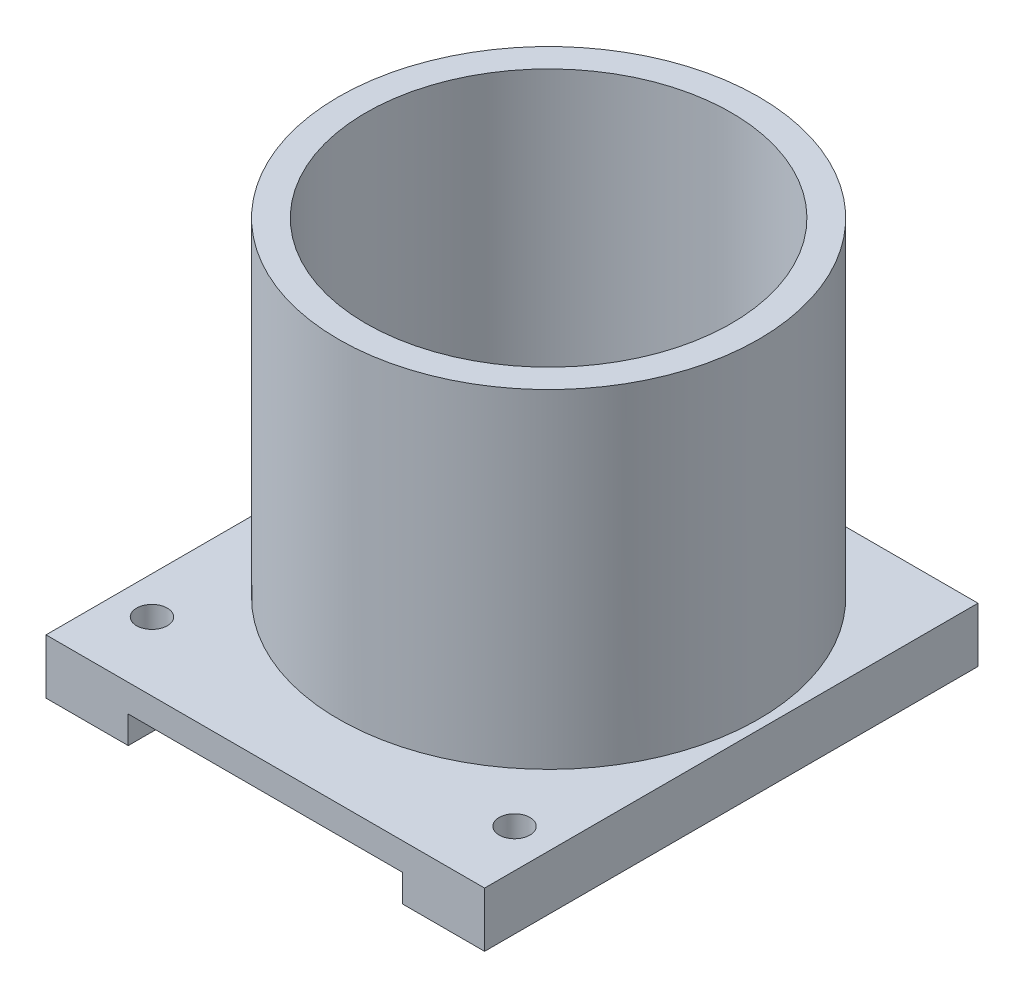
ISO-10303-21;
HEADER;
FILE_DESCRIPTION(('STEP AP214'),'2;1');
FILE_NAME('part.step','',(''),(''),'','','');
FILE_SCHEMA(('AUTOMOTIVE_DESIGN { 1 0 10303 214 1 1 1 1 }'));
ENDSEC;
DATA;
#1=APPLICATION_CONTEXT('core data for automotive mechanical design processes');
#2=APPLICATION_PROTOCOL_DEFINITION('international standard','automotive_design',2000,#1);
#3=PRODUCT_CONTEXT('',#1,'mechanical');
#4=PRODUCT('Part','Part','',(#3));
#5=PRODUCT_RELATED_PRODUCT_CATEGORY('part','',(#4));
#6=PRODUCT_DEFINITION_FORMATION('','',#4);
#7=PRODUCT_DEFINITION_CONTEXT('part definition',#1,'design');
#8=PRODUCT_DEFINITION('design','',#6,#7);
#9=PRODUCT_DEFINITION_SHAPE('','',#8);
#10=(LENGTH_UNIT() NAMED_UNIT(*) SI_UNIT(.MILLI.,.METRE.));
#11=(NAMED_UNIT(*) PLANE_ANGLE_UNIT() SI_UNIT($,.RADIAN.));
#12=(NAMED_UNIT(*) SI_UNIT($,.STERADIAN.) SOLID_ANGLE_UNIT());
#13=UNCERTAINTY_MEASURE_WITH_UNIT(LENGTH_MEASURE(1.E-05),#10,'distance_accuracy_value','');
#14=(GEOMETRIC_REPRESENTATION_CONTEXT(3) GLOBAL_UNCERTAINTY_ASSIGNED_CONTEXT((#13)) GLOBAL_UNIT_ASSIGNED_CONTEXT((#10,
#11,#12)) REPRESENTATION_CONTEXT('',''));
#15=CARTESIAN_POINT('',(0.,0.,0.));
#16=DIRECTION('',(0.,0.,1.));
#17=DIRECTION('',(1.,0.,0.));
#18=AXIS2_PLACEMENT_3D('',#15,#16,#17);
#19=CARTESIAN_POINT('',(0.,-3.175,0.));
#20=DIRECTION('',(0.,-1.,0.));
#21=DIRECTION('',(0.,0.,-1.));
#22=AXIS2_PLACEMENT_3D('',#19,#20,#21);
#23=PLANE('',#22);
#24=DIRECTION('',(0.,0.,1.));
#25=VECTOR('',#24,1.);
#26=CARTESIAN_POINT('',(7.9375,-3.175,18.5411314784116));
#27=LINE('',#26,#25);
#28=CARTESIAN_POINT('',(7.9375,-3.175,-12.1666));
#29=VERTEX_POINT('',#28);
#30=CARTESIAN_POINT('',(7.9375,-3.175,16.4084));
#31=VERTEX_POINT('',#30);
#32=EDGE_CURVE('E117',#29,#31,#27,.T.);
#33=ORIENTED_EDGE('',*,*,#32,.F.);
#34=DIRECTION('',(1.,0.,0.));
#35=VECTOR('',#34,1.);
#36=CARTESIAN_POINT('',(-12.7,-3.175,-12.1666));
#37=LINE('',#36,#35);
#38=CARTESIAN_POINT('',(12.7,-3.175,-12.1666));
#39=VERTEX_POINT('',#38);
#40=EDGE_CURVE('E129',#29,#39,#37,.T.);
#41=ORIENTED_EDGE('',*,*,#40,.T.);
#42=DIRECTION('',(0.,0.,1.));
#43=VECTOR('',#42,1.);
#44=CARTESIAN_POINT('',(12.7,-3.175,16.4084));
#45=LINE('',#44,#43);
#46=CARTESIAN_POINT('',(12.7,-3.175,16.4084));
#47=VERTEX_POINT('',#46);
#48=EDGE_CURVE('E155',#39,#47,#45,.T.);
#49=ORIENTED_EDGE('',*,*,#48,.T.);
#50=DIRECTION('',(-1.,0.,0.));
#51=VECTOR('',#50,1.);
#52=CARTESIAN_POINT('',(-12.7,-3.175,16.4084));
#53=LINE('',#52,#51);
#54=EDGE_CURVE('E131',#47,#31,#53,.T.);
#55=ORIENTED_EDGE('',*,*,#54,.T.);
#56=EDGE_LOOP('',(#33,#41,#49,#55));
#57=FACE_BOUND('',#56,.T.);
#58=CARTESIAN_POINT('',(10.4684762650792,-3.175,-0.058620672138098));
#59=DIRECTION('',(0.,-1.,0.));
#60=DIRECTION('',(0.,0.,-1.));
#61=AXIS2_PLACEMENT_3D('',#58,#59,#60);
#62=CIRCLE('',#61,0.888999999999989);
#63=CARTESIAN_POINT('',(10.4684762650792,-3.175,-0.947620672138087));
#64=VERTEX_POINT('',#63);
#65=EDGE_CURVE('E195',#64,#64,#62,.T.);
#66=ORIENTED_EDGE('',*,*,#65,.F.);
#67=EDGE_LOOP('',(#66));
#68=FACE_BOUND('',#67,.T.);
#69=CARTESIAN_POINT('',(10.4684762650792,-3.175,12.4413793278619));
#70=DIRECTION('',(0.,-1.,0.));
#71=DIRECTION('',(0.,0.,-1.));
#72=AXIS2_PLACEMENT_3D('',#69,#70,#71);
#73=CIRCLE('',#72,0.888999999999989);
#74=CARTESIAN_POINT('',(10.4684762650792,-3.175,11.5523793278619));
#75=VERTEX_POINT('',#74);
#76=EDGE_CURVE('E201',#75,#75,#73,.T.);
#77=ORIENTED_EDGE('',*,*,#76,.F.);
#78=EDGE_LOOP('',(#77));
#79=FACE_BOUND('',#78,.T.);
#80=ADVANCED_FACE('F37',(#57,#68,#79),#23,.T.);
#81=CARTESIAN_POINT('',(0.,19.05,0.));
#82=DIRECTION('',(0.,-1.,0.));
#83=DIRECTION('',(0.,0.,-1.));
#84=AXIS2_PLACEMENT_3D('',#81,#82,#83);
#85=CYLINDRICAL_SURFACE('',#84,6.35);
#86=CARTESIAN_POINT('',(0.,0.127000000000002,0.));
#87=DIRECTION('',(0.,-1.,0.));
#88=DIRECTION('',(0.,0.,-1.));
#89=AXIS2_PLACEMENT_3D('',#86,#87,#88);
#90=CIRCLE('',#89,6.35);
#91=CARTESIAN_POINT('',(0.,0.127000000000002,-6.35));
#92=VERTEX_POINT('',#91);
#93=EDGE_CURVE('E149',#92,#92,#90,.T.);
#94=ORIENTED_EDGE('',*,*,#93,.F.);
#95=EDGE_LOOP('',(#94));
#96=FACE_BOUND('',#95,.T.);
#97=CARTESIAN_POINT('',(0.,-1.5875,0.));
#98=DIRECTION('',(0.,-1.,0.));
#99=DIRECTION('',(0.,0.,-1.));
#100=AXIS2_PLACEMENT_3D('',#97,#98,#99);
#101=CIRCLE('',#100,6.35);
#102=CARTESIAN_POINT('',(0.,-1.5875,-6.35));
#103=VERTEX_POINT('',#102);
#104=EDGE_CURVE('E41',#103,#103,#101,.F.);
#105=ORIENTED_EDGE('',*,*,#104,.F.);
#106=EDGE_LOOP('',(#105));
#107=FACE_BOUND('',#106,.T.);
#108=ADVANCED_FACE('F254',(#96,#107),#85,.F.);
#109=CARTESIAN_POINT('',(0.,19.05,0.));
#110=DIRECTION('',(0.,-1.,0.));
#111=DIRECTION('',(0.,0.,-1.));
#112=AXIS2_PLACEMENT_3D('',#109,#110,#111);
#113=CYLINDRICAL_SURFACE('',#112,10.5791);
#114=CARTESIAN_POINT('',(0.,3.302,0.));
#115=DIRECTION('',(0.,1.,0.));
#116=DIRECTION('',(0.,0.,1.));
#117=AXIS2_PLACEMENT_3D('',#114,#115,#116);
#118=CIRCLE('',#117,10.5791);
#119=CARTESIAN_POINT('',(0.,3.302,10.5791));
#120=VERTEX_POINT('',#119);
#121=EDGE_CURVE('E12',#120,#120,#118,.T.);
#122=ORIENTED_EDGE('',*,*,#121,.F.);
#123=EDGE_LOOP('',(#122));
#124=FACE_BOUND('',#123,.T.);
#125=CARTESIAN_POINT('',(0.,19.05,0.));
#126=DIRECTION('',(0.,1.,0.));
#127=DIRECTION('',(0.,0.,1.));
#128=AXIS2_PLACEMENT_3D('',#125,#126,#127);
#129=CIRCLE('',#128,10.5791);
#130=CARTESIAN_POINT('',(0.,19.05,10.5791));
#131=VERTEX_POINT('',#130);
#132=EDGE_CURVE('E165',#131,#131,#129,.T.);
#133=ORIENTED_EDGE('',*,*,#132,.T.);
#134=EDGE_LOOP('',(#133));
#135=FACE_BOUND('',#134,.T.);
#136=ADVANCED_FACE('F259',(#124,#135),#113,.F.);
#137=CARTESIAN_POINT('',(0.,19.05,0.));
#138=DIRECTION('',(0.,1.,0.));
#139=DIRECTION('',(0.,0.,1.));
#140=AXIS2_PLACEMENT_3D('',#137,#138,#139);
#141=PLANE('',#140);
#142=CARTESIAN_POINT('',(0.,19.05,0.));
#143=DIRECTION('',(0.,1.,0.));
#144=DIRECTION('',(0.,0.,1.));
#145=AXIS2_PLACEMENT_3D('',#142,#143,#144);
#146=CIRCLE('',#145,12.1666);
#147=CARTESIAN_POINT('',(0.,19.05,12.1666));
#148=VERTEX_POINT('',#147);
#149=EDGE_CURVE('E46',#148,#148,#146,.T.);
#150=ORIENTED_EDGE('',*,*,#149,.T.);
#151=EDGE_LOOP('',(#150));
#152=FACE_BOUND('',#151,.T.);
#153=ORIENTED_EDGE('',*,*,#132,.F.);
#154=EDGE_LOOP('',(#153));
#155=FACE_BOUND('',#154,.T.);
#156=ADVANCED_FACE('F409',(#152,#155),#141,.T.);
#157=CARTESIAN_POINT('',(0.,19.05,0.));
#158=DIRECTION('',(0.,-1.,0.));
#159=DIRECTION('',(0.,0.,-1.));
#160=AXIS2_PLACEMENT_3D('',#157,#158,#159);
#161=CYLINDRICAL_SURFACE('',#160,12.1666);
#162=ORIENTED_EDGE('',*,*,#149,.F.);
#163=EDGE_LOOP('',(#162));
#164=FACE_BOUND('',#163,.T.);
#165=CARTESIAN_POINT('',(0.,0.,0.));
#166=DIRECTION('',(0.,1.,0.));
#167=DIRECTION('',(0.,0.,1.));
#168=AXIS2_PLACEMENT_3D('',#165,#166,#167);
#169=CIRCLE('',#168,12.1666);
#170=CARTESIAN_POINT('',(0.,0.,-12.1666));
#171=VERTEX_POINT('',#170);
#172=EDGE_CURVE('E168',#171,#171,#169,.T.);
#173=ORIENTED_EDGE('',*,*,#172,.T.);
#174=EDGE_LOOP('',(#173));
#175=FACE_BOUND('',#174,.T.);
#176=ADVANCED_FACE('F39',(#164,#175),#161,.T.);
#177=CARTESIAN_POINT('',(12.7,-3.175,16.4084));
#178=DIRECTION('',(-1.,0.,0.));
#179=DIRECTION('',(0.,0.,1.));
#180=AXIS2_PLACEMENT_3D('',#177,#178,#179);
#181=PLANE('',#180);
#182=DIRECTION('',(0.,0.,1.));
#183=VECTOR('',#182,1.);
#184=CARTESIAN_POINT('',(12.7,0.,16.4084));
#185=LINE('',#184,#183);
#186=CARTESIAN_POINT('',(12.7,0.,-12.1666));
#187=VERTEX_POINT('',#186);
#188=CARTESIAN_POINT('',(12.7,0.,16.4084));
#189=VERTEX_POINT('',#188);
#190=EDGE_CURVE('E145',#187,#189,#185,.T.);
#191=ORIENTED_EDGE('',*,*,#190,.T.);
#192=DIRECTION('',(0.,1.,0.));
#193=VECTOR('',#192,1.);
#194=CARTESIAN_POINT('',(12.7,-3.175,16.4084));
#195=LINE('',#194,#193);
#196=EDGE_CURVE('E162',#47,#189,#195,.T.);
#197=ORIENTED_EDGE('',*,*,#196,.F.);
#198=ORIENTED_EDGE('',*,*,#48,.F.);
#199=DIRECTION('',(0.,1.,0.));
#200=VECTOR('',#199,1.);
#201=CARTESIAN_POINT('',(12.7,-3.175,-12.1666));
#202=LINE('',#201,#200);
#203=EDGE_CURVE('E136',#39,#187,#202,.T.);
#204=ORIENTED_EDGE('',*,*,#203,.T.);
#205=EDGE_LOOP('',(#191,#197,#198,#204));
#206=FACE_BOUND('',#205,.T.);
#207=ADVANCED_FACE('F179',(#206),#181,.F.);
#208=CARTESIAN_POINT('',(-12.7,-3.175,16.4084));
#209=DIRECTION('',(0.,0.,-1.));
#210=DIRECTION('',(-1.,0.,0.));
#211=AXIS2_PLACEMENT_3D('',#208,#209,#210);
#212=PLANE('',#211);
#213=DIRECTION('',(-1.,0.,0.));
#214=VECTOR('',#213,1.);
#215=CARTESIAN_POINT('',(-12.7,-1.5875,16.4084));
#216=LINE('',#215,#214);
#217=CARTESIAN_POINT('',(7.9375,-1.5875,16.4084));
#218=VERTEX_POINT('',#217);
#219=CARTESIAN_POINT('',(-7.9375,-1.5875,16.4084));
#220=VERTEX_POINT('',#219);
#221=EDGE_CURVE('E221',#218,#220,#216,.T.);
#222=ORIENTED_EDGE('',*,*,#221,.F.);
#223=DIRECTION('',(0.,-1.,0.));
#224=VECTOR('',#223,1.);
#225=CARTESIAN_POINT('',(7.9375,-3.175,16.4084));
#226=LINE('',#225,#224);
#227=EDGE_CURVE('E123',#218,#31,#226,.T.);
#228=ORIENTED_EDGE('',*,*,#227,.T.);
#229=ORIENTED_EDGE('',*,*,#54,.F.);
#230=ORIENTED_EDGE('',*,*,#196,.T.);
#231=DIRECTION('',(-1.,0.,0.));
#232=VECTOR('',#231,1.);
#233=CARTESIAN_POINT('',(-12.7,0.,16.4084));
#234=LINE('',#233,#232);
#235=CARTESIAN_POINT('',(-12.7,0.,16.4084));
#236=VERTEX_POINT('',#235);
#237=EDGE_CURVE('E148',#189,#236,#234,.T.);
#238=ORIENTED_EDGE('',*,*,#237,.T.);
#239=DIRECTION('',(0.,1.,0.));
#240=VECTOR('',#239,1.);
#241=CARTESIAN_POINT('',(-12.7,-3.175,16.4084));
#242=LINE('',#241,#240);
#243=CARTESIAN_POINT('',(-12.7,-3.175,16.4084));
#244=VERTEX_POINT('',#243);
#245=EDGE_CURVE('E159',#244,#236,#242,.T.);
#246=ORIENTED_EDGE('',*,*,#245,.F.);
#247=CARTESIAN_POINT('',(-7.9375,-3.175,16.4084));
#248=VERTEX_POINT('',#247);
#249=EDGE_CURVE('E181',#248,#244,#53,.T.);
#250=ORIENTED_EDGE('',*,*,#249,.F.);
#251=DIRECTION('',(0.,1.,0.));
#252=VECTOR('',#251,1.);
#253=CARTESIAN_POINT('',(-7.9375,-3.175,16.4084));
#254=LINE('',#253,#252);
#255=EDGE_CURVE('E53',#248,#220,#254,.T.);
#256=ORIENTED_EDGE('',*,*,#255,.T.);
#257=EDGE_LOOP('',(#222,#228,#229,#230,#238,#246,#250,#256));
#258=FACE_BOUND('',#257,.T.);
#259=ADVANCED_FACE('F233',(#258),#212,.F.);
#260=CARTESIAN_POINT('',(-12.7,-3.175,16.4084));
#261=DIRECTION('',(1.,0.,0.));
#262=DIRECTION('',(0.,0.,-1.));
#263=AXIS2_PLACEMENT_3D('',#260,#261,#262);
#264=PLANE('',#263);
#265=DIRECTION('',(0.,0.,-1.));
#266=VECTOR('',#265,1.);
#267=CARTESIAN_POINT('',(-12.7,0.,16.4084));
#268=LINE('',#267,#266);
#269=CARTESIAN_POINT('',(-12.7,0.,-12.1666));
#270=VERTEX_POINT('',#269);
#271=EDGE_CURVE('E151',#236,#270,#268,.T.);
#272=ORIENTED_EDGE('',*,*,#271,.T.);
#273=DIRECTION('',(0.,1.,0.));
#274=VECTOR('',#273,1.);
#275=CARTESIAN_POINT('',(-12.7,-3.175,-12.1666));
#276=LINE('',#275,#274);
#277=CARTESIAN_POINT('',(-12.7,-3.175,-12.1666));
#278=VERTEX_POINT('',#277);
#279=EDGE_CURVE('E157',#278,#270,#276,.T.);
#280=ORIENTED_EDGE('',*,*,#279,.F.);
#281=DIRECTION('',(0.,0.,-1.));
#282=VECTOR('',#281,1.);
#283=CARTESIAN_POINT('',(-12.7,-3.175,16.4084));
#284=LINE('',#283,#282);
#285=EDGE_CURVE('E139',#244,#278,#284,.T.);
#286=ORIENTED_EDGE('',*,*,#285,.F.);
#287=ORIENTED_EDGE('',*,*,#245,.T.);
#288=EDGE_LOOP('',(#272,#280,#286,#287));
#289=FACE_BOUND('',#288,.T.);
#290=ADVANCED_FACE('F244',(#289),#264,.F.);
#291=CARTESIAN_POINT('',(-12.7,-3.175,-12.1666));
#292=DIRECTION('',(0.,0.,1.));
#293=DIRECTION('',(1.,0.,0.));
#294=AXIS2_PLACEMENT_3D('',#291,#292,#293);
#295=PLANE('',#294);
#296=ORIENTED_EDGE('',*,*,#40,.F.);
#297=DIRECTION('',(0.,1.,0.));
#298=VECTOR('',#297,1.);
#299=CARTESIAN_POINT('',(7.93750000000001,-3.175,-12.1666));
#300=LINE('',#299,#298);
#301=CARTESIAN_POINT('',(7.9375,-1.5875,-12.1666));
#302=VERTEX_POINT('',#301);
#303=EDGE_CURVE('E114',#29,#302,#300,.T.);
#304=ORIENTED_EDGE('',*,*,#303,.T.);
#305=DIRECTION('',(1.,0.,0.));
#306=VECTOR('',#305,1.);
#307=CARTESIAN_POINT('',(-12.7,-1.5875,-12.1666));
#308=LINE('',#307,#306);
#309=CARTESIAN_POINT('',(-7.9375,-1.5875,-12.1666));
#310=VERTEX_POINT('',#309);
#311=EDGE_CURVE('E223',#310,#302,#308,.T.);
#312=ORIENTED_EDGE('',*,*,#311,.F.);
#313=DIRECTION('',(0.,-1.,0.));
#314=VECTOR('',#313,1.);
#315=CARTESIAN_POINT('',(-7.9375,-3.175,-12.1666));
#316=LINE('',#315,#314);
#317=CARTESIAN_POINT('',(-7.9375,-3.175,-12.1666));
#318=VERTEX_POINT('',#317);
#319=EDGE_CURVE('E218',#310,#318,#316,.T.);
#320=ORIENTED_EDGE('',*,*,#319,.T.);
#321=EDGE_CURVE('E138',#278,#318,#37,.T.);
#322=ORIENTED_EDGE('',*,*,#321,.F.);
#323=ORIENTED_EDGE('',*,*,#279,.T.);
#324=DIRECTION('',(1.,0.,0.));
#325=VECTOR('',#324,1.);
#326=CARTESIAN_POINT('',(-12.7,0.,-12.1666));
#327=LINE('',#326,#325);
#328=EDGE_CURVE('E61',#270,#171,#327,.T.);
#329=ORIENTED_EDGE('',*,*,#328,.T.);
#330=EDGE_CURVE('E153',#171,#187,#327,.T.);
#331=ORIENTED_EDGE('',*,*,#330,.T.);
#332=ORIENTED_EDGE('',*,*,#203,.F.);
#333=EDGE_LOOP('',(#296,#304,#312,#320,#322,#323,#329,#331,#332));
#334=FACE_BOUND('',#333,.T.);
#335=ADVANCED_FACE('F134',(#334),#295,.F.);
#336=DIRECTION('',(0.,0.,-1.));
#337=VECTOR('',#336,1.);
#338=CARTESIAN_POINT('',(-7.9375,-3.175,18.5411314784116));
#339=LINE('',#338,#337);
#340=EDGE_CURVE('E132',#248,#318,#339,.T.);
#341=ORIENTED_EDGE('',*,*,#340,.F.);
#342=ORIENTED_EDGE('',*,*,#249,.T.);
#343=ORIENTED_EDGE('',*,*,#285,.T.);
#344=ORIENTED_EDGE('',*,*,#321,.T.);
#345=EDGE_LOOP('',(#341,#342,#343,#344));
#346=FACE_BOUND('',#345,.T.);
#347=CARTESIAN_POINT('',(-10.5315237349208,-3.175,12.4413793278619));
#348=DIRECTION('',(0.,-1.,0.));
#349=DIRECTION('',(0.,0.,-1.));
#350=AXIS2_PLACEMENT_3D('',#347,#348,#349);
#351=CIRCLE('',#350,0.888999999999989);
#352=CARTESIAN_POINT('',(-10.5315237349208,-3.175,11.5523793278619));
#353=VERTEX_POINT('',#352);
#354=EDGE_CURVE('E213',#353,#353,#351,.T.);
#355=ORIENTED_EDGE('',*,*,#354,.F.);
#356=EDGE_LOOP('',(#355));
#357=FACE_BOUND('',#356,.T.);
#358=CARTESIAN_POINT('',(-10.5315237349208,-3.175,-0.058620672138098));
#359=DIRECTION('',(0.,-1.,0.));
#360=DIRECTION('',(0.,0.,-1.));
#361=AXIS2_PLACEMENT_3D('',#358,#359,#360);
#362=CIRCLE('',#361,0.888999999999989);
#363=CARTESIAN_POINT('',(-10.5315237349208,-3.175,-0.947620672138087));
#364=VERTEX_POINT('',#363);
#365=EDGE_CURVE('E207',#364,#364,#362,.T.);
#366=ORIENTED_EDGE('',*,*,#365,.F.);
#367=EDGE_LOOP('',(#366));
#368=FACE_BOUND('',#367,.T.);
#369=ADVANCED_FACE('F238',(#346,#357,#368),#23,.T.);
#370=CARTESIAN_POINT('',(0.,0.,0.));
#371=DIRECTION('',(0.,-1.,0.));
#372=DIRECTION('',(0.,0.,-1.));
#373=AXIS2_PLACEMENT_3D('',#370,#371,#372);
#374=PLANE('',#373);
#375=CARTESIAN_POINT('',(-10.5315237349208,0.,12.4413793278619));
#376=DIRECTION('',(0.,-1.,0.));
#377=DIRECTION('',(0.,0.,-1.));
#378=AXIS2_PLACEMENT_3D('',#375,#376,#377);
#379=CIRCLE('',#378,0.888999999999993);
#380=CARTESIAN_POINT('',(-10.5315237349208,0.,11.5523793278619));
#381=VERTEX_POINT('',#380);
#382=EDGE_CURVE('E210',#381,#381,#379,.T.);
#383=ORIENTED_EDGE('',*,*,#382,.T.);
#384=EDGE_LOOP('',(#383));
#385=FACE_BOUND('',#384,.T.);
#386=CARTESIAN_POINT('',(10.4684762650792,0.,12.4413793278619));
#387=DIRECTION('',(0.,-1.,0.));
#388=DIRECTION('',(0.,0.,-1.));
#389=AXIS2_PLACEMENT_3D('',#386,#387,#388);
#390=CIRCLE('',#389,0.888999999999993);
#391=CARTESIAN_POINT('',(10.4684762650792,0.,11.5523793278619));
#392=VERTEX_POINT('',#391);
#393=EDGE_CURVE('E198',#392,#392,#390,.T.);
#394=ORIENTED_EDGE('',*,*,#393,.T.);
#395=EDGE_LOOP('',(#394));
#396=FACE_BOUND('',#395,.T.);
#397=ORIENTED_EDGE('',*,*,#330,.F.);
#398=ORIENTED_EDGE('',*,*,#172,.F.);
#399=ORIENTED_EDGE('',*,*,#328,.F.);
#400=ORIENTED_EDGE('',*,*,#271,.F.);
#401=ORIENTED_EDGE('',*,*,#237,.F.);
#402=ORIENTED_EDGE('',*,*,#190,.F.);
#403=EDGE_LOOP('',(#397,#398,#399,#400,#401,#402));
#404=FACE_BOUND('',#403,.T.);
#405=ADVANCED_FACE('F175',(#385,#396,#404),#374,.F.);
#406=CARTESIAN_POINT('',(0.,0.127,0.));
#407=DIRECTION('',(0.,1.,0.));
#408=DIRECTION('',(0.,0.,1.));
#409=AXIS2_PLACEMENT_3D('',#406,#407,#408);
#410=PLANE('',#409);
#411=CARTESIAN_POINT('',(0.,0.127,0.));
#412=DIRECTION('',(0.,1.,0.));
#413=DIRECTION('',(0.,0.,1.));
#414=AXIS2_PLACEMENT_3D('',#411,#412,#413);
#415=CIRCLE('',#414,3.96875);
#416=CARTESIAN_POINT('',(0.,0.127,3.96875));
#417=VERTEX_POINT('',#416);
#418=EDGE_CURVE('E187',#417,#417,#415,.T.);
#419=ORIENTED_EDGE('',*,*,#418,.T.);
#420=EDGE_LOOP('',(#419));
#421=FACE_BOUND('',#420,.T.);
#422=ORIENTED_EDGE('',*,*,#93,.T.);
#423=EDGE_LOOP('',(#422));
#424=FACE_BOUND('',#423,.T.);
#425=ADVANCED_FACE('F267',(#421,#424),#410,.F.);
#426=CARTESIAN_POINT('',(0.,3.302,0.));
#427=DIRECTION('',(0.,1.,0.));
#428=DIRECTION('',(0.,0.,1.));
#429=AXIS2_PLACEMENT_3D('',#426,#427,#428);
#430=PLANE('',#429);
#431=ORIENTED_EDGE('',*,*,#121,.T.);
#432=EDGE_LOOP('',(#431));
#433=FACE_BOUND('',#432,.T.);
#434=CARTESIAN_POINT('',(0.,3.302,0.));
#435=DIRECTION('',(0.,1.,0.));
#436=DIRECTION('',(0.,0.,1.));
#437=AXIS2_PLACEMENT_3D('',#434,#435,#436);
#438=CIRCLE('',#437,3.96875);
#439=CARTESIAN_POINT('',(0.,3.302,3.96875));
#440=VERTEX_POINT('',#439);
#441=EDGE_CURVE('E186',#440,#440,#438,.T.);
#442=ORIENTED_EDGE('',*,*,#441,.F.);
#443=EDGE_LOOP('',(#442));
#444=FACE_BOUND('',#443,.T.);
#445=ADVANCED_FACE('F272',(#433,#444),#430,.T.);
#446=CARTESIAN_POINT('',(0.,3.302,0.));
#447=DIRECTION('',(0.,-1.,0.));
#448=DIRECTION('',(0.,0.,-1.));
#449=AXIS2_PLACEMENT_3D('',#446,#447,#448);
#450=CYLINDRICAL_SURFACE('',#449,3.96875);
#451=ORIENTED_EDGE('',*,*,#441,.T.);
#452=EDGE_LOOP('',(#451));
#453=FACE_BOUND('',#452,.T.);
#454=ORIENTED_EDGE('',*,*,#418,.F.);
#455=EDGE_LOOP('',(#454));
#456=FACE_BOUND('',#455,.T.);
#457=ADVANCED_FACE('F299',(#453,#456),#450,.F.);
#458=CARTESIAN_POINT('',(10.4684762650792,2.413,-0.058620672138098));
#459=DIRECTION('',(0.,-1.,0.));
#460=DIRECTION('',(0.,0.,-1.));
#461=AXIS2_PLACEMENT_3D('',#458,#459,#460);
#462=CONICAL_SURFACE('',#461,0.888999999999997,1.02974425867665);
#463=CARTESIAN_POINT('',(10.4684762650792,2.9471650903155,-0.058620672138098));
#464=VERTEX_POINT('',#463);
#465=VERTEX_LOOP('',#464);
#466=FACE_BOUND('',#465,.T.);
#467=CARTESIAN_POINT('',(10.4684762650792,2.413,-0.058620672138098));
#468=DIRECTION('',(0.,-1.,0.));
#469=DIRECTION('',(0.,0.,-1.));
#470=AXIS2_PLACEMENT_3D('',#467,#468,#469);
#471=CIRCLE('',#470,0.888999999999997);
#472=CARTESIAN_POINT('',(10.4684762650792,2.413,-0.947620672138095));
#473=VERTEX_POINT('',#472);
#474=EDGE_CURVE('E190',#473,#473,#471,.T.);
#475=ORIENTED_EDGE('',*,*,#474,.T.);
#476=EDGE_LOOP('',(#475));
#477=FACE_BOUND('',#476,.T.);
#478=ADVANCED_FACE('F292',(#466,#477),#462,.F.);
#479=CARTESIAN_POINT('',(10.4684762650792,-3.175,-0.058620672138098));
#480=DIRECTION('',(0.,-1.,0.));
#481=DIRECTION('',(0.,0.,-1.));
#482=AXIS2_PLACEMENT_3D('',#479,#480,#481);
#483=CYLINDRICAL_SURFACE('',#482,0.888999999999993);
#484=ORIENTED_EDGE('',*,*,#474,.F.);
#485=EDGE_LOOP('',(#484));
#486=FACE_BOUND('',#485,.T.);
#487=ORIENTED_EDGE('',*,*,#65,.T.);
#488=EDGE_LOOP('',(#487));
#489=FACE_BOUND('',#488,.T.);
#490=ADVANCED_FACE('F282',(#486,#489),#483,.F.);
#491=CARTESIAN_POINT('',(10.4684762650792,-3.175,12.4413793278619));
#492=DIRECTION('',(0.,-1.,0.));
#493=DIRECTION('',(0.,0.,-1.));
#494=AXIS2_PLACEMENT_3D('',#491,#492,#493);
#495=CYLINDRICAL_SURFACE('',#494,0.888999999999993);
#496=ORIENTED_EDGE('',*,*,#76,.T.);
#497=EDGE_LOOP('',(#496));
#498=FACE_BOUND('',#497,.T.);
#499=ORIENTED_EDGE('',*,*,#393,.F.);
#500=EDGE_LOOP('',(#499));
#501=FACE_BOUND('',#500,.T.);
#502=ADVANCED_FACE('F279',(#498,#501),#495,.F.);
#503=CARTESIAN_POINT('',(-10.5315237349208,2.413,-0.058620672138098));
#504=DIRECTION('',(0.,-1.,0.));
#505=DIRECTION('',(0.,0.,-1.));
#506=AXIS2_PLACEMENT_3D('',#503,#504,#505);
#507=CONICAL_SURFACE('',#506,0.888999999999997,1.02974425867665);
#508=CARTESIAN_POINT('',(-10.5315237349208,2.9471650903155,-0.058620672138098));
#509=VERTEX_POINT('',#508);
#510=VERTEX_LOOP('',#509);
#511=FACE_BOUND('',#510,.T.);
#512=CARTESIAN_POINT('',(-10.5315237349208,2.413,-0.058620672138098));
#513=DIRECTION('',(0.,-1.,0.));
#514=DIRECTION('',(0.,0.,-1.));
#515=AXIS2_PLACEMENT_3D('',#512,#513,#514);
#516=CIRCLE('',#515,0.888999999999997);
#517=CARTESIAN_POINT('',(-10.5315237349208,2.413,-0.947620672138095));
#518=VERTEX_POINT('',#517);
#519=EDGE_CURVE('E204',#518,#518,#516,.T.);
#520=ORIENTED_EDGE('',*,*,#519,.T.);
#521=EDGE_LOOP('',(#520));
#522=FACE_BOUND('',#521,.T.);
#523=ADVANCED_FACE('F281',(#511,#522),#507,.F.);
#524=CARTESIAN_POINT('',(-10.5315237349208,-3.175,-0.058620672138098));
#525=DIRECTION('',(0.,-1.,0.));
#526=DIRECTION('',(0.,0.,-1.));
#527=AXIS2_PLACEMENT_3D('',#524,#525,#526);
#528=CYLINDRICAL_SURFACE('',#527,0.888999999999993);
#529=ORIENTED_EDGE('',*,*,#519,.F.);
#530=EDGE_LOOP('',(#529));
#531=FACE_BOUND('',#530,.T.);
#532=ORIENTED_EDGE('',*,*,#365,.T.);
#533=EDGE_LOOP('',(#532));
#534=FACE_BOUND('',#533,.T.);
#535=ADVANCED_FACE('F289',(#531,#534),#528,.F.);
#536=CARTESIAN_POINT('',(-10.5315237349208,-3.175,12.4413793278619));
#537=DIRECTION('',(0.,-1.,0.));
#538=DIRECTION('',(0.,0.,-1.));
#539=AXIS2_PLACEMENT_3D('',#536,#537,#538);
#540=CYLINDRICAL_SURFACE('',#539,0.888999999999993);
#541=ORIENTED_EDGE('',*,*,#354,.T.);
#542=EDGE_LOOP('',(#541));
#543=FACE_BOUND('',#542,.T.);
#544=ORIENTED_EDGE('',*,*,#382,.F.);
#545=EDGE_LOOP('',(#544));
#546=FACE_BOUND('',#545,.T.);
#547=ADVANCED_FACE('F328',(#543,#546),#540,.F.);
#548=CARTESIAN_POINT('',(7.9375,-1.5875,18.5411314784116));
#549=DIRECTION('',(1.,0.,0.));
#550=DIRECTION('',(0.,0.,-1.));
#551=AXIS2_PLACEMENT_3D('',#548,#549,#550);
#552=PLANE('',#551);
#553=DIRECTION('',(0.,0.,1.));
#554=VECTOR('',#553,1.);
#555=CARTESIAN_POINT('',(7.9375,-1.5875,18.5411314784116));
#556=LINE('',#555,#554);
#557=EDGE_CURVE('E120',#302,#218,#556,.T.);
#558=ORIENTED_EDGE('',*,*,#557,.F.);
#559=ORIENTED_EDGE('',*,*,#303,.F.);
#560=ORIENTED_EDGE('',*,*,#32,.T.);
#561=ORIENTED_EDGE('',*,*,#227,.F.);
#562=EDGE_LOOP('',(#558,#559,#560,#561));
#563=FACE_BOUND('',#562,.T.);
#564=ADVANCED_FACE('F116',(#563),#552,.F.);
#565=CARTESIAN_POINT('',(-7.9375,-1.5875,18.5411314784116));
#566=DIRECTION('',(-1.,0.,0.));
#567=DIRECTION('',(0.,0.,1.));
#568=AXIS2_PLACEMENT_3D('',#565,#566,#567);
#569=PLANE('',#568);
#570=ORIENTED_EDGE('',*,*,#340,.T.);
#571=ORIENTED_EDGE('',*,*,#319,.F.);
#572=DIRECTION('',(0.,0.,-1.));
#573=VECTOR('',#572,1.);
#574=CARTESIAN_POINT('',(-7.9375,-1.5875,18.5411314784116));
#575=LINE('',#574,#573);
#576=EDGE_CURVE('E226',#220,#310,#575,.T.);
#577=ORIENTED_EDGE('',*,*,#576,.F.);
#578=ORIENTED_EDGE('',*,*,#255,.F.);
#579=EDGE_LOOP('',(#570,#571,#577,#578));
#580=FACE_BOUND('',#579,.T.);
#581=ADVANCED_FACE('F242',(#580),#569,.F.);
#582=CARTESIAN_POINT('',(0.,-1.5875,0.));
#583=DIRECTION('',(0.,-1.,0.));
#584=DIRECTION('',(0.,0.,-1.));
#585=AXIS2_PLACEMENT_3D('',#582,#583,#584);
#586=PLANE('',#585);
#587=ORIENTED_EDGE('',*,*,#104,.T.);
#588=EDGE_LOOP('',(#587));
#589=FACE_BOUND('',#588,.T.);
#590=ORIENTED_EDGE('',*,*,#221,.T.);
#591=ORIENTED_EDGE('',*,*,#576,.T.);
#592=ORIENTED_EDGE('',*,*,#311,.T.);
#593=ORIENTED_EDGE('',*,*,#557,.T.);
#594=EDGE_LOOP('',(#590,#591,#592,#593));
#595=FACE_BOUND('',#594,.T.);
#596=ADVANCED_FACE('F231',(#589,#595),#586,.T.);
#597=CLOSED_SHELL('',(#80,#108,#136,#156,#176,#207,#259,#290,#335,#369,#405,#425,#445,#457,#478,
#490,#502,#523,#535,#547,#564,#581,#596));
#598=MANIFOLD_SOLID_BREP('B2',#597);
#599=ADVANCED_BREP_SHAPE_REPRESENTATION('',(#18,#598),#14);
#600=SHAPE_DEFINITION_REPRESENTATION(#9,#599);
ENDSEC;
END-ISO-10303-21;
